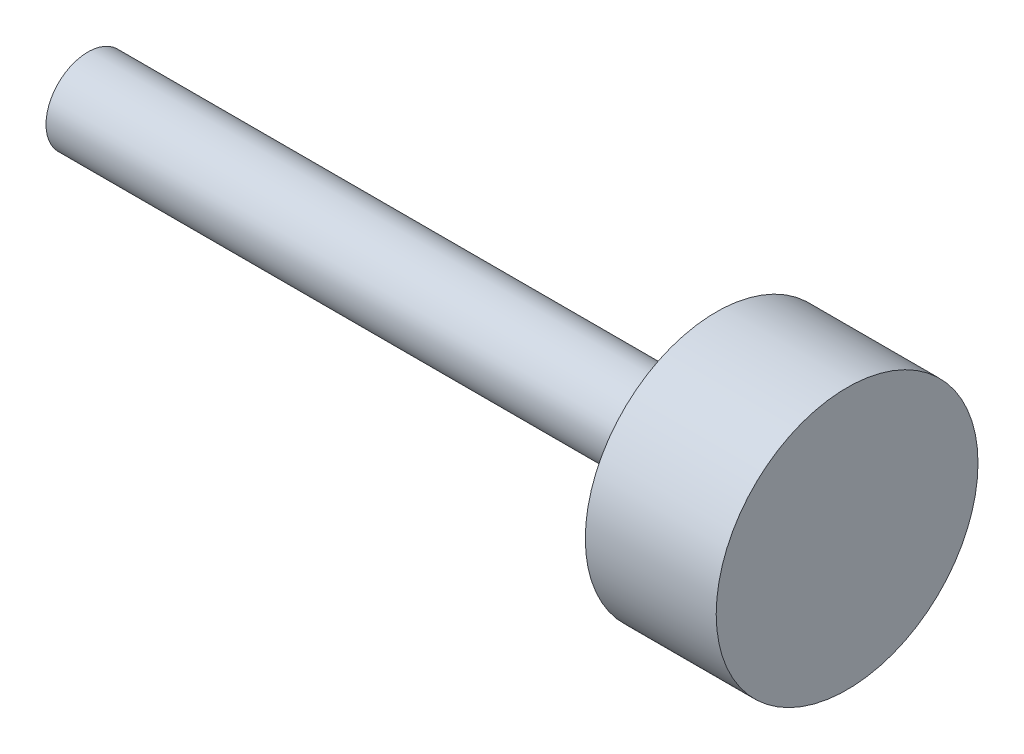
ISO-10303-21;
HEADER;
FILE_DESCRIPTION(('STEP AP214'),'2;1');
FILE_NAME('part.step','',(''),(''),'','','');
FILE_SCHEMA(('AUTOMOTIVE_DESIGN { 1 0 10303 214 1 1 1 1 }'));
ENDSEC;
DATA;
#1=APPLICATION_CONTEXT('core data for automotive mechanical design processes');
#2=APPLICATION_PROTOCOL_DEFINITION('international standard','automotive_design',2000,#1);
#3=PRODUCT_CONTEXT('',#1,'mechanical');
#4=PRODUCT('Part','Part','',(#3));
#5=PRODUCT_RELATED_PRODUCT_CATEGORY('part','',(#4));
#6=PRODUCT_DEFINITION_FORMATION('','',#4);
#7=PRODUCT_DEFINITION_CONTEXT('part definition',#1,'design');
#8=PRODUCT_DEFINITION('design','',#6,#7);
#9=PRODUCT_DEFINITION_SHAPE('','',#8);
#10=(LENGTH_UNIT() NAMED_UNIT(*) SI_UNIT(.MILLI.,.METRE.));
#11=(NAMED_UNIT(*) PLANE_ANGLE_UNIT() SI_UNIT($,.RADIAN.));
#12=(NAMED_UNIT(*) SI_UNIT($,.STERADIAN.) SOLID_ANGLE_UNIT());
#13=UNCERTAINTY_MEASURE_WITH_UNIT(LENGTH_MEASURE(1.E-05),#10,'distance_accuracy_value','');
#14=(GEOMETRIC_REPRESENTATION_CONTEXT(3) GLOBAL_UNCERTAINTY_ASSIGNED_CONTEXT((#13)) GLOBAL_UNIT_ASSIGNED_CONTEXT((#10,
#11,#12)) REPRESENTATION_CONTEXT('',''));
#15=CARTESIAN_POINT('',(0.,0.,0.));
#16=DIRECTION('',(0.,0.,1.));
#17=DIRECTION('',(1.,0.,0.));
#18=AXIS2_PLACEMENT_3D('',#15,#16,#17);
#19=CARTESIAN_POINT('',(0.,0.508,0.));
#20=DIRECTION('',(1.,0.,0.));
#21=DIRECTION('',(0.,0.,-1.));
#22=AXIS2_PLACEMENT_3D('',#19,#20,#21);
#23=PLANE('',#22);
#24=CARTESIAN_POINT('',(0.,0.,0.));
#25=DIRECTION('',(-1.,0.,0.));
#26=DIRECTION('',(0.,0.,1.));
#27=AXIS2_PLACEMENT_3D('',#24,#25,#26);
#28=CIRCLE('',#27,0.508);
#29=CARTESIAN_POINT('',(0.,0.,0.508));
#30=VERTEX_POINT('',#29);
#31=EDGE_CURVE('E60',#30,#30,#28,.T.);
#32=ORIENTED_EDGE('',*,*,#31,.T.);
#33=EDGE_LOOP('',(#32));
#34=FACE_BOUND('',#33,.T.);
#35=ADVANCED_FACE('F43',(#34),#23,.F.);
#36=CARTESIAN_POINT('',(9.2075,0.,0.));
#37=DIRECTION('',(-1.,0.,0.));
#38=DIRECTION('',(0.,0.,1.));
#39=AXIS2_PLACEMENT_3D('',#36,#37,#38);
#40=PLANE('',#39);
#41=CARTESIAN_POINT('',(9.2075,0.,0.));
#42=DIRECTION('',(-1.,0.,0.));
#43=DIRECTION('',(0.,0.,1.));
#44=AXIS2_PLACEMENT_3D('',#41,#42,#43);
#45=CIRCLE('',#44,1.5875);
#46=CARTESIAN_POINT('',(9.2075,0.,1.5875));
#47=VERTEX_POINT('',#46);
#48=EDGE_CURVE('E10',#47,#47,#45,.T.);
#49=ORIENTED_EDGE('',*,*,#48,.F.);
#50=EDGE_LOOP('',(#49));
#51=FACE_BOUND('',#50,.T.);
#52=ADVANCED_FACE('F81',(#51),#40,.F.);
#53=CARTESIAN_POINT('',(0.,0.,0.));
#54=DIRECTION('',(-1.,0.,0.));
#55=DIRECTION('',(0.,0.,1.));
#56=AXIS2_PLACEMENT_3D('',#53,#54,#55);
#57=CYLINDRICAL_SURFACE('',#56,1.5875);
#58=CARTESIAN_POINT('',(7.62,0.,0.));
#59=DIRECTION('',(-1.,0.,0.));
#60=DIRECTION('',(0.,0.,1.));
#61=AXIS2_PLACEMENT_3D('',#58,#59,#60);
#62=CIRCLE('',#61,1.5875);
#63=CARTESIAN_POINT('',(7.62,0.,1.5875));
#64=VERTEX_POINT('',#63);
#65=EDGE_CURVE('E50',#64,#64,#62,.T.);
#66=ORIENTED_EDGE('',*,*,#65,.F.);
#67=EDGE_LOOP('',(#66));
#68=FACE_BOUND('',#67,.T.);
#69=ORIENTED_EDGE('',*,*,#48,.T.);
#70=EDGE_LOOP('',(#69));
#71=FACE_BOUND('',#70,.T.);
#72=ADVANCED_FACE('F76',(#68,#71),#57,.T.);
#73=CARTESIAN_POINT('',(7.62,1.5875,0.));
#74=DIRECTION('',(1.,0.,0.));
#75=DIRECTION('',(0.,0.,-1.));
#76=AXIS2_PLACEMENT_3D('',#73,#74,#75);
#77=PLANE('',#76);
#78=CARTESIAN_POINT('',(7.62,0.,0.));
#79=DIRECTION('',(-1.,0.,0.));
#80=DIRECTION('',(0.,0.,1.));
#81=AXIS2_PLACEMENT_3D('',#78,#79,#80);
#82=CIRCLE('',#81,0.508000000000001);
#83=CARTESIAN_POINT('',(7.62,0.,0.508000000000001));
#84=VERTEX_POINT('',#83);
#85=EDGE_CURVE('E55',#84,#84,#82,.T.);
#86=ORIENTED_EDGE('',*,*,#85,.F.);
#87=EDGE_LOOP('',(#86));
#88=FACE_BOUND('',#87,.T.);
#89=ORIENTED_EDGE('',*,*,#65,.T.);
#90=EDGE_LOOP('',(#89));
#91=FACE_BOUND('',#90,.T.);
#92=ADVANCED_FACE('F71',(#88,#91),#77,.F.);
#93=CARTESIAN_POINT('',(0.,0.,0.));
#94=DIRECTION('',(-1.,0.,0.));
#95=DIRECTION('',(0.,0.,1.));
#96=AXIS2_PLACEMENT_3D('',#93,#94,#95);
#97=CYLINDRICAL_SURFACE('',#96,0.508);
#98=ORIENTED_EDGE('',*,*,#31,.F.);
#99=EDGE_LOOP('',(#98));
#100=FACE_BOUND('',#99,.T.);
#101=ORIENTED_EDGE('',*,*,#85,.T.);
#102=EDGE_LOOP('',(#101));
#103=FACE_BOUND('',#102,.T.);
#104=ADVANCED_FACE('F68',(#100,#103),#97,.T.);
#105=CLOSED_SHELL('',(#35,#52,#72,#92,#104));
#106=MANIFOLD_SOLID_BREP('B2',#105);
#107=ADVANCED_BREP_SHAPE_REPRESENTATION('',(#18,#106),#14);
#108=SHAPE_DEFINITION_REPRESENTATION(#9,#107);
ENDSEC;
END-ISO-10303-21;
